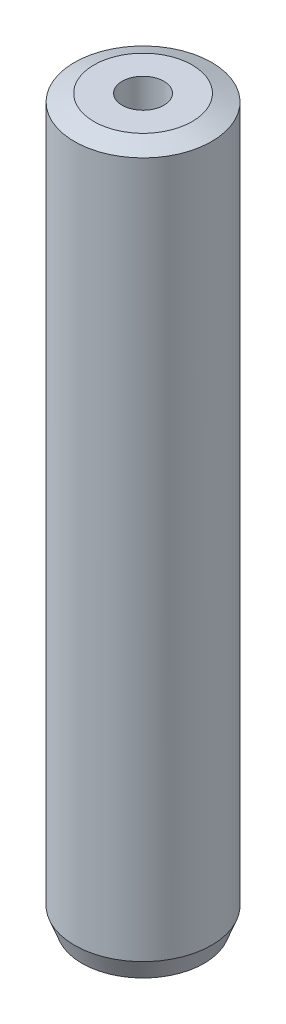
ISO-10303-21;
HEADER;
FILE_DESCRIPTION(('STEP AP214'),'2;1');
FILE_NAME('part.step','',(''),(''),'','','');
FILE_SCHEMA(('AUTOMOTIVE_DESIGN { 1 0 10303 214 1 1 1 1 }'));
ENDSEC;
DATA;
#1=APPLICATION_CONTEXT('core data for automotive mechanical design processes');
#2=APPLICATION_PROTOCOL_DEFINITION('international standard','automotive_design',2000,#1);
#3=PRODUCT_CONTEXT('',#1,'mechanical');
#4=PRODUCT('Part','Part','',(#3));
#5=PRODUCT_RELATED_PRODUCT_CATEGORY('part','',(#4));
#6=PRODUCT_DEFINITION_FORMATION('','',#4);
#7=PRODUCT_DEFINITION_CONTEXT('part definition',#1,'design');
#8=PRODUCT_DEFINITION('design','',#6,#7);
#9=PRODUCT_DEFINITION_SHAPE('','',#8);
#10=(LENGTH_UNIT() NAMED_UNIT(*) SI_UNIT(.MILLI.,.METRE.));
#11=(NAMED_UNIT(*) PLANE_ANGLE_UNIT() SI_UNIT($,.RADIAN.));
#12=(NAMED_UNIT(*) SI_UNIT($,.STERADIAN.) SOLID_ANGLE_UNIT());
#13=UNCERTAINTY_MEASURE_WITH_UNIT(LENGTH_MEASURE(1.E-05),#10,'distance_accuracy_value','');
#14=(GEOMETRIC_REPRESENTATION_CONTEXT(3) GLOBAL_UNCERTAINTY_ASSIGNED_CONTEXT((#13)) GLOBAL_UNIT_ASSIGNED_CONTEXT((#10,
#11,#12)) REPRESENTATION_CONTEXT('',''));
#15=CARTESIAN_POINT('',(0.,0.,0.));
#16=DIRECTION('',(0.,0.,1.));
#17=DIRECTION('',(1.,0.,0.));
#18=AXIS2_PLACEMENT_3D('',#15,#16,#17);
#19=CARTESIAN_POINT('',(0.,448.029516357089,0.));
#20=DIRECTION('',(0.,-1.,0.));
#21=DIRECTION('',(0.,0.,-1.));
#22=AXIS2_PLACEMENT_3D('',#19,#20,#21);
#23=CYLINDRICAL_SURFACE('',#22,42.5);
#24=CARTESIAN_POINT('',(0.,443.369478394105,0.));
#25=DIRECTION('',(0.,1.,0.));
#26=DIRECTION('',(0.,0.,1.));
#27=AXIS2_PLACEMENT_3D('',#24,#25,#26);
#28=CIRCLE('',#27,42.5);
#29=CARTESIAN_POINT('',(0.,443.369478394105,-42.5));
#30=VERTEX_POINT('',#29);
#31=EDGE_CURVE('E50',#30,#30,#28,.F.);
#32=CARTESIAN_POINT('',(0.,12.0872367069151,0.));
#33=DIRECTION('',(0.,1.,0.));
#34=DIRECTION('',(0.,0.,1.));
#35=AXIS2_PLACEMENT_3D('',#32,#33,#34);
#36=CIRCLE('',#35,42.5);
#37=CARTESIAN_POINT('',(0.,12.087236706915,-42.5));
#38=VERTEX_POINT('',#37);
#39=EDGE_CURVE('E51',#38,#38,#36,.T.);
#40=CARTESIAN_POINT('',(0.,443.369478394105,-42.5));
#41=CARTESIAN_POINT('',(0.,438.876955043196,-42.5));
#42=CARTESIAN_POINT('',(0.,434.384431692288,-42.5));
#43=CARTESIAN_POINT('',(0.,425.399384990472,-42.5));
#44=CARTESIAN_POINT('',(0.,420.906861639564,-42.5));
#45=CARTESIAN_POINT('',(0.,411.921814937747,-42.5));
#46=CARTESIAN_POINT('',(0.,407.429291586839,-42.5));
#47=CARTESIAN_POINT('',(0.,398.444244885022,-42.5));
#48=CARTESIAN_POINT('',(0.,393.951721534114,-42.5));
#49=CARTESIAN_POINT('',(0.,384.966674832298,-42.5));
#50=CARTESIAN_POINT('',(0.,380.47415148139,-42.5));
#51=CARTESIAN_POINT('',(0.,371.489104779573,-42.5));
#52=CARTESIAN_POINT('',(0.,366.996581428665,-42.5));
#53=CARTESIAN_POINT('',(0.,358.011534726848,-42.5));
#54=CARTESIAN_POINT('',(0.,353.51901137594,-42.5));
#55=CARTESIAN_POINT('',(0.,344.533964674124,-42.5));
#56=CARTESIAN_POINT('',(0.,340.041441323215,-42.5));
#57=CARTESIAN_POINT('',(0.,331.056394621399,-42.5));
#58=CARTESIAN_POINT('',(0.,326.563871270491,-42.5));
#59=CARTESIAN_POINT('',(0.,317.578824568674,-42.5));
#60=CARTESIAN_POINT('',(0.,313.086301217766,-42.5));
#61=CARTESIAN_POINT('',(0.,304.10125451595,-42.5));
#62=CARTESIAN_POINT('',(0.,299.608731165041,-42.5));
#63=CARTESIAN_POINT('',(0.,290.623684463225,-42.5));
#64=CARTESIAN_POINT('',(0.,286.131161112317,-42.5));
#65=CARTESIAN_POINT('',(0.,277.1461144105,-42.5));
#66=CARTESIAN_POINT('',(0.,272.653591059592,-42.5));
#67=CARTESIAN_POINT('',(0.,263.668544357776,-42.5));
#68=CARTESIAN_POINT('',(0.,259.176021006867,-42.5));
#69=CARTESIAN_POINT('',(0.,250.190974305051,-42.5));
#70=CARTESIAN_POINT('',(0.,245.698450954143,-42.5));
#71=CARTESIAN_POINT('',(0.,236.713404252326,-42.5));
#72=CARTESIAN_POINT('',(0.,232.220880901418,-42.5));
#73=CARTESIAN_POINT('',(0.,223.235834199602,-42.5));
#74=CARTESIAN_POINT('',(0.,218.743310848693,-42.5));
#75=CARTESIAN_POINT('',(0.,209.758264146877,-42.5));
#76=CARTESIAN_POINT('',(0.,205.265740795969,-42.5));
#77=CARTESIAN_POINT('',(0.,196.280694094152,-42.5));
#78=CARTESIAN_POINT('',(0.,191.788170743244,-42.5));
#79=CARTESIAN_POINT('',(0.,182.803124041428,-42.5));
#80=CARTESIAN_POINT('',(0.,178.310600690519,-42.5));
#81=CARTESIAN_POINT('',(0.,169.325553988703,-42.5));
#82=CARTESIAN_POINT('',(0.,164.833030637795,-42.5));
#83=CARTESIAN_POINT('',(0.,155.847983935978,-42.5));
#84=CARTESIAN_POINT('',(0.,151.35546058507,-42.5));
#85=CARTESIAN_POINT('',(0.,142.370413883254,-42.5));
#86=CARTESIAN_POINT('',(0.,137.877890532345,-42.5));
#87=CARTESIAN_POINT('',(0.,128.892843830529,-42.5));
#88=CARTESIAN_POINT('',(0.,124.400320479621,-42.5));
#89=CARTESIAN_POINT('',(0.,115.415273777804,-42.5));
#90=CARTESIAN_POINT('',(0.,110.922750426896,-42.5));
#91=CARTESIAN_POINT('',(0.,101.93770372508,-42.5));
#92=CARTESIAN_POINT('',(0.,97.4451803741713,-42.5));
#93=CARTESIAN_POINT('',(0.,88.4601336723549,-42.5));
#94=CARTESIAN_POINT('',(0.,83.9676103214466,-42.5));
#95=CARTESIAN_POINT('',(0.,74.9825636196302,-42.5));
#96=CARTESIAN_POINT('',(0.,70.490040268722,-42.5));
#97=CARTESIAN_POINT('',(0.,61.5049935669055,-42.5));
#98=CARTESIAN_POINT('',(0.,57.0124702159973,-42.5));
#99=CARTESIAN_POINT('',(0.,48.0274235141808,-42.5));
#100=CARTESIAN_POINT('',(0.,43.5349001632726,-42.5));
#101=CARTESIAN_POINT('',(0.,34.5498534614562,-42.5));
#102=CARTESIAN_POINT('',(0.,30.0573301105479,-42.5));
#103=CARTESIAN_POINT('',(0.,21.0722834087315,-42.5));
#104=CARTESIAN_POINT('',(0.,16.5797600578232,-42.5));
#105=CARTESIAN_POINT('',(0.,12.087236706915,-42.5));
#106=B_SPLINE_CURVE_WITH_KNOTS('',3,(#40,#41,#42,#43,#44,#45,#46,#47,#48,#49,#50,#51,#52,#53,
#54,#55,#56,#57,#58,#59,#60,#61,#62,#63,#64,#65,#66,#67,#68,#69,#70,#71,#72,#73,#74,#75,#76,#77,
#78,#79,#80,#81,#82,#83,#84,#85,#86,#87,#88,#89,#90,#91,#92,#93,#94,#95,#96,#97,#98,#99,#100,
#101,#102,#103,#104,#105),.UNSPECIFIED.,.F.,.F.,(4,2,2,2,2,2,2,2,2,2,2,2,2,2,2,2,2,2,2,2,2,2,2,
2,2,2,2,2,2,2,2,2,4),(0.,13.4775700527247,26.9551401054493,40.432710158174,53.9102802108987,
67.3878502636233,80.865420316348,94.3429903690727,107.820560421797,121.298130474522,
134.775700527247,148.253270579971,161.730840632696,175.208410685421,188.685980738145,
202.16355079087,215.641120843595,229.118690896319,242.596260949044,256.073831001769,
269.551401054494,283.028971107218,296.506541159943,309.984111212668,323.461681265392,
336.939251318117,350.416821370841,363.894391423566,377.371961476291,390.849531529016,
404.32710158174,417.804671634465,431.28224168719),.UNSPECIFIED.);
#107=EDGE_CURVE('BSEAM39',#30,#38,#106,.T.);
#108=ORIENTED_EDGE('',*,*,#31,.T.);
#109=ORIENTED_EDGE('',*,*,#39,.T.);
#110=ORIENTED_EDGE('',*,*,#107,.T.);
#111=ORIENTED_EDGE('',*,*,#107,.F.);
#112=EDGE_LOOP('',(#108,#110,#109,#111));
#113=FACE_BOUND('',#112,.T.);
#114=ADVANCED_FACE('F39',(#113),#23,.T.);
#115=CARTESIAN_POINT('',(0.,448.029516357089,0.));
#116=DIRECTION('',(0.,1.,0.));
#117=DIRECTION('',(0.,0.,1.));
#118=AXIS2_PLACEMENT_3D('',#115,#116,#117);
#119=PLANE('',#118);
#120=CARTESIAN_POINT('',(0.,448.029516357089,0.));
#121=DIRECTION('',(0.,1.,0.));
#122=DIRECTION('',(0.,0.,1.));
#123=AXIS2_PLACEMENT_3D('',#120,#121,#122);
#124=CIRCLE('',#123,30.4127632930864);
#125=CARTESIAN_POINT('',(0.,448.029516357089,30.4127632930864));
#126=VERTEX_POINT('',#125);
#127=EDGE_CURVE('E54',#126,#126,#124,.T.);
#128=ORIENTED_EDGE('',*,*,#127,.T.);
#129=EDGE_LOOP('',(#128));
#130=FACE_BOUND('',#129,.T.);
#131=CARTESIAN_POINT('',(0.,448.029516357089,0.));
#132=DIRECTION('',(0.,1.,0.));
#133=DIRECTION('',(0.,0.,1.));
#134=AXIS2_PLACEMENT_3D('',#131,#132,#133);
#135=CIRCLE('',#134,12.9211573658608);
#136=CARTESIAN_POINT('',(0.,448.029516357089,-12.9211573658608));
#137=VERTEX_POINT('',#136);
#138=EDGE_CURVE('E58',#137,#137,#135,.T.);
#139=ORIENTED_EDGE('',*,*,#138,.F.);
#140=EDGE_LOOP('',(#139));
#141=FACE_BOUND('',#140,.T.);
#142=ADVANCED_FACE('F69',(#130,#141),#119,.T.);
#143=CARTESIAN_POINT('',(0.,0.,0.));
#144=DIRECTION('',(0.,1.,0.));
#145=DIRECTION('',(0.,0.,1.));
#146=AXIS2_PLACEMENT_3D('',#143,#144,#145);
#147=PLANE('',#146);
#148=CARTESIAN_POINT('',(0.,0.,0.));
#149=DIRECTION('',(0.,1.,0.));
#150=DIRECTION('',(0.,0.,1.));
#151=AXIS2_PLACEMENT_3D('',#148,#149,#150);
#152=CIRCLE('',#151,37.8399620370153);
#153=CARTESIAN_POINT('',(0.,0.,37.8399620370153));
#154=VERTEX_POINT('',#153);
#155=EDGE_CURVE('E10',#154,#154,#152,.F.);
#156=ORIENTED_EDGE('',*,*,#155,.T.);
#157=EDGE_LOOP('',(#156));
#158=FACE_BOUND('',#157,.T.);
#159=CARTESIAN_POINT('',(0.,0.,0.));
#160=DIRECTION('',(0.,1.,0.));
#161=DIRECTION('',(0.,0.,1.));
#162=AXIS2_PLACEMENT_3D('',#159,#160,#161);
#163=CIRCLE('',#162,12.9211573658608);
#164=CARTESIAN_POINT('',(0.,0.,-12.9211573658608));
#165=VERTEX_POINT('',#164);
#166=EDGE_CURVE('E63',#165,#165,#163,.T.);
#167=ORIENTED_EDGE('',*,*,#166,.T.);
#168=EDGE_LOOP('',(#167));
#169=FACE_BOUND('',#168,.T.);
#170=ADVANCED_FACE('F75',(#158,#169),#147,.F.);
#171=CARTESIAN_POINT('',(0.,448.029516357089,0.));
#172=DIRECTION('',(0.,-1.,0.));
#173=DIRECTION('',(0.,0.,-1.));
#174=AXIS2_PLACEMENT_3D('',#171,#172,#173);
#175=CYLINDRICAL_SURFACE('',#174,12.9211573658608);
#176=CARTESIAN_POINT('',(0.,448.029516357089,-12.9211573658608));
#177=CARTESIAN_POINT('',(0.,443.362542228369,-12.9211573658608));
#178=CARTESIAN_POINT('',(0.,438.695568099649,-12.9211573658608));
#179=CARTESIAN_POINT('',(0.,429.36161984221,-12.9211573658608));
#180=CARTESIAN_POINT('',(0.,424.69464571349,-12.9211573658608));
#181=CARTESIAN_POINT('',(0.,415.360697456051,-12.9211573658608));
#182=CARTESIAN_POINT('',(0.,410.693723327331,-12.9211573658608));
#183=CARTESIAN_POINT('',(0.,401.359775069892,-12.9211573658608));
#184=CARTESIAN_POINT('',(0.,396.692800941172,-12.9211573658608));
#185=CARTESIAN_POINT('',(0.,387.358852683733,-12.9211573658608));
#186=CARTESIAN_POINT('',(0.,382.691878555013,-12.9211573658608));
#187=CARTESIAN_POINT('',(0.,373.357930297574,-12.9211573658608));
#188=CARTESIAN_POINT('',(0.,368.690956168854,-12.9211573658608));
#189=CARTESIAN_POINT('',(0.,359.357007911415,-12.9211573658608));
#190=CARTESIAN_POINT('',(0.,354.690033782695,-12.9211573658608));
#191=CARTESIAN_POINT('',(0.,345.356085525256,-12.9211573658608));
#192=CARTESIAN_POINT('',(0.,340.689111396536,-12.9211573658608));
#193=CARTESIAN_POINT('',(0.,331.355163139097,-12.9211573658608));
#194=CARTESIAN_POINT('',(0.,326.688189010377,-12.9211573658608));
#195=CARTESIAN_POINT('',(0.,317.354240752938,-12.9211573658608));
#196=CARTESIAN_POINT('',(0.,312.687266624218,-12.9211573658608));
#197=CARTESIAN_POINT('',(0.,303.353318366779,-12.9211573658608));
#198=CARTESIAN_POINT('',(0.,298.686344238059,-12.9211573658608));
#199=CARTESIAN_POINT('',(0.,289.35239598062,-12.9211573658608));
#200=CARTESIAN_POINT('',(0.,284.6854218519,-12.9211573658608));
#201=CARTESIAN_POINT('',(0.,275.351473594461,-12.9211573658608));
#202=CARTESIAN_POINT('',(0.,270.684499465741,-12.9211573658608));
#203=CARTESIAN_POINT('',(0.,261.350551208302,-12.9211573658608));
#204=CARTESIAN_POINT('',(0.,256.683577079582,-12.9211573658608));
#205=CARTESIAN_POINT('',(0.,247.349628822143,-12.9211573658608));
#206=CARTESIAN_POINT('',(0.,242.682654693423,-12.9211573658608));
#207=CARTESIAN_POINT('',(0.,233.348706435984,-12.9211573658608));
#208=CARTESIAN_POINT('',(0.,228.681732307264,-12.9211573658608));
#209=CARTESIAN_POINT('',(0.,219.347784049825,-12.9211573658608));
#210=CARTESIAN_POINT('',(0.,214.680809921105,-12.9211573658608));
#211=CARTESIAN_POINT('',(0.,205.346861663666,-12.9211573658608));
#212=CARTESIAN_POINT('',(0.,200.679887534946,-12.9211573658608));
#213=CARTESIAN_POINT('',(0.,191.345939277507,-12.9211573658608));
#214=CARTESIAN_POINT('',(0.,186.678965148787,-12.9211573658608));
#215=CARTESIAN_POINT('',(0.,177.345016891348,-12.9211573658608));
#216=CARTESIAN_POINT('',(0.,172.678042762628,-12.9211573658608));
#217=CARTESIAN_POINT('',(0.,163.344094505189,-12.9211573658608));
#218=CARTESIAN_POINT('',(0.,158.677120376469,-12.9211573658608));
#219=CARTESIAN_POINT('',(0.,149.34317211903,-12.9211573658608));
#220=CARTESIAN_POINT('',(0.,144.67619799031,-12.9211573658608));
#221=CARTESIAN_POINT('',(0.,135.342249732871,-12.9211573658608));
#222=CARTESIAN_POINT('',(0.,130.675275604151,-12.9211573658608));
#223=CARTESIAN_POINT('',(0.,121.341327346712,-12.9211573658608));
#224=CARTESIAN_POINT('',(0.,116.674353217992,-12.9211573658608));
#225=CARTESIAN_POINT('',(0.,107.340404960553,-12.9211573658608));
#226=CARTESIAN_POINT('',(0.,102.673430831833,-12.9211573658608));
#227=CARTESIAN_POINT('',(0.,93.3394825743935,-12.9211573658608));
#228=CARTESIAN_POINT('',(0.,88.6725084456739,-12.9211573658608));
#229=CARTESIAN_POINT('',(0.,79.3385601882345,-12.9211573658608));
#230=CARTESIAN_POINT('',(0.,74.6715860595148,-12.9211573658608));
#231=CARTESIAN_POINT('',(0.,65.3376378020755,-12.9211573658608));
#232=CARTESIAN_POINT('',(0.,60.6706636733558,-12.9211573658608));
#233=CARTESIAN_POINT('',(0.,51.3367154159164,-12.9211573658608));
#234=CARTESIAN_POINT('',(0.,46.6697412871967,-12.9211573658608));
#235=CARTESIAN_POINT('',(0.,37.3357930297574,-12.9211573658608));
#236=CARTESIAN_POINT('',(0.,32.6688189010377,-12.9211573658608));
#237=CARTESIAN_POINT('',(0.,23.3348706435984,-12.9211573658608));
#238=CARTESIAN_POINT('',(0.,18.6678965148787,-12.9211573658608));
#239=CARTESIAN_POINT('',(0.,9.33394825743935,-12.9211573658608));
#240=CARTESIAN_POINT('',(0.,4.66697412871967,-12.9211573658608));
#241=CARTESIAN_POINT('',(0.,0.,-12.9211573658608));
#242=B_SPLINE_CURVE_WITH_KNOTS('',3,(#176,#177,#178,#179,#180,#181,#182,#183,#184,#185,#186,
#187,#188,#189,#190,#191,#192,#193,#194,#195,#196,#197,#198,#199,#200,#201,#202,#203,#204,#205,
#206,#207,#208,#209,#210,#211,#212,#213,#214,#215,#216,#217,#218,#219,#220,#221,#222,#223,#224,
#225,#226,#227,#228,#229,#230,#231,#232,#233,#234,#235,#236,#237,#238,#239,#240,#241),
.UNSPECIFIED.,.F.,.F.,(4,2,2,2,2,2,2,2,2,2,2,2,2,2,2,2,2,2,2,2,2,2,2,2,2,2,2,2,2,2,2,2,4),(0.,
14.0009223861591,28.0018447723181,42.0027671584771,56.0036895446361,70.0046119307952,
84.0055343169542,98.0064567031132,112.007379089272,126.008301475431,140.00922386159,
154.010146247749,168.011068633908,182.011991020067,196.012913406226,210.013835792385,
224.014758178544,238.015680564703,252.016602950862,266.017525337021,280.01844772318,
294.01937010934,308.020292495499,322.021214881658,336.022137267817,350.023059653976,
364.023982040135,378.024904426294,392.025826812453,406.026749198612,420.027671584771,
434.02859397093,448.029516357089),.UNSPECIFIED.);
#243=EDGE_CURVE('BSEAM70',#137,#165,#242,.T.);
#244=ORIENTED_EDGE('',*,*,#138,.T.);
#245=ORIENTED_EDGE('',*,*,#166,.F.);
#246=ORIENTED_EDGE('',*,*,#243,.T.);
#247=ORIENTED_EDGE('',*,*,#243,.F.);
#248=EDGE_LOOP('',(#244,#246,#245,#247));
#249=FACE_BOUND('',#248,.T.);
#250=ADVANCED_FACE('F70',(#249),#175,.F.);
#251=CARTESIAN_POINT('',(0.,448.029516357089,0.));
#252=DIRECTION('',(0.,-1.,0.));
#253=DIRECTION('',(0.,0.,-1.));
#254=AXIS2_PLACEMENT_3D('',#251,#252,#253);
#255=CONICAL_SURFACE('',#254,30.4127632930864,1.20282270058773);
#256=ORIENTED_EDGE('',*,*,#31,.F.);
#257=EDGE_LOOP('',(#256));
#258=FACE_BOUND('',#257,.T.);
#259=ORIENTED_EDGE('',*,*,#127,.F.);
#260=EDGE_LOOP('',(#259));
#261=FACE_BOUND('',#260,.T.);
#262=ADVANCED_FACE('F81',(#258,#261),#255,.T.);
#263=CARTESIAN_POINT('',(0.,12.0872367069151,0.));
#264=DIRECTION('',(0.,1.,0.));
#265=DIRECTION('',(0.,0.,1.));
#266=AXIS2_PLACEMENT_3D('',#263,#264,#265);
#267=CONICAL_SURFACE('',#266,42.5,0.367973626207166);
#268=ORIENTED_EDGE('',*,*,#155,.F.);
#269=EDGE_LOOP('',(#268));
#270=FACE_BOUND('',#269,.T.);
#271=ORIENTED_EDGE('',*,*,#39,.F.);
#272=EDGE_LOOP('',(#271));
#273=FACE_BOUND('',#272,.T.);
#274=ADVANCED_FACE('F45',(#270,#273),#267,.T.);
#275=CLOSED_SHELL('',(#114,#142,#170,#250,#262,#274));
#276=MANIFOLD_SOLID_BREP('B2',#275);
#277=ADVANCED_BREP_SHAPE_REPRESENTATION('',(#18,#276),#14);
#278=SHAPE_DEFINITION_REPRESENTATION(#9,#277);
ENDSEC;
END-ISO-10303-21;
